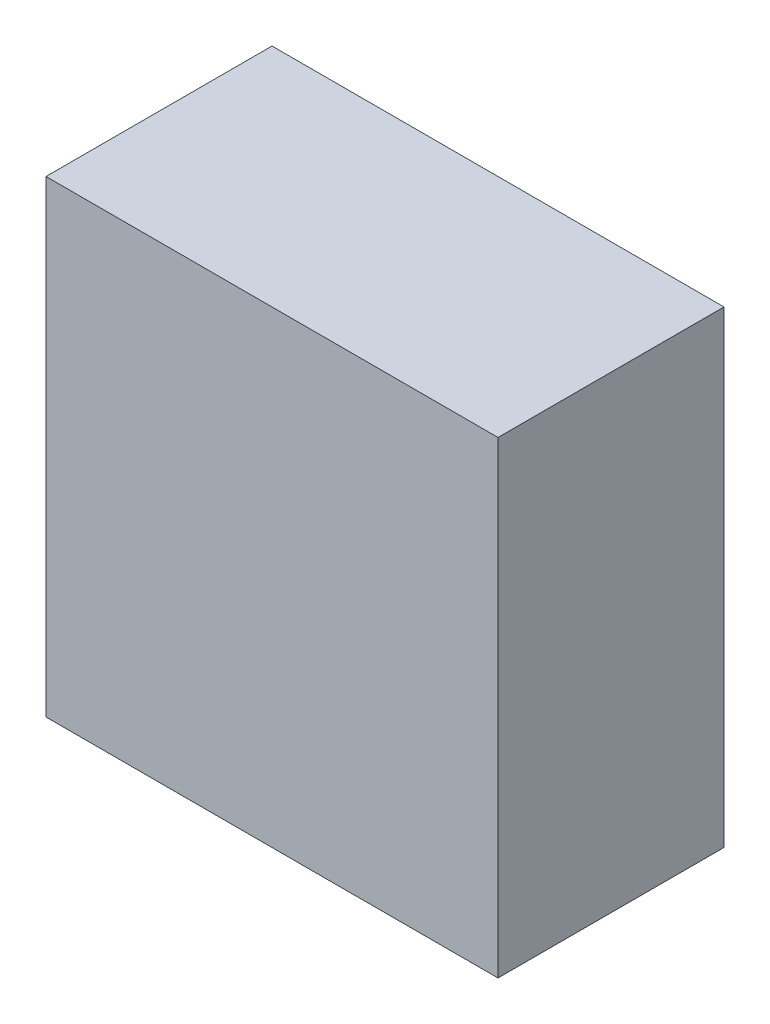
ISO-10303-21;
HEADER;
FILE_DESCRIPTION(('STEP AP214'),'2;1');
FILE_NAME('part.step','',(''),(''),'','','');
FILE_SCHEMA(('AUTOMOTIVE_DESIGN { 1 0 10303 214 1 1 1 1 }'));
ENDSEC;
DATA;
#1=APPLICATION_CONTEXT('core data for automotive mechanical design processes');
#2=APPLICATION_PROTOCOL_DEFINITION('international standard','automotive_design',2000,#1);
#3=PRODUCT_CONTEXT('',#1,'mechanical');
#4=PRODUCT('Part','Part','',(#3));
#5=PRODUCT_RELATED_PRODUCT_CATEGORY('part','',(#4));
#6=PRODUCT_DEFINITION_FORMATION('','',#4);
#7=PRODUCT_DEFINITION_CONTEXT('part definition',#1,'design');
#8=PRODUCT_DEFINITION('design','',#6,#7);
#9=PRODUCT_DEFINITION_SHAPE('','',#8);
#10=(LENGTH_UNIT() NAMED_UNIT(*) SI_UNIT(.MILLI.,.METRE.));
#11=(NAMED_UNIT(*) PLANE_ANGLE_UNIT() SI_UNIT($,.RADIAN.));
#12=(NAMED_UNIT(*) SI_UNIT($,.STERADIAN.) SOLID_ANGLE_UNIT());
#13=UNCERTAINTY_MEASURE_WITH_UNIT(LENGTH_MEASURE(1.E-05),#10,'distance_accuracy_value','');
#14=(GEOMETRIC_REPRESENTATION_CONTEXT(3) GLOBAL_UNCERTAINTY_ASSIGNED_CONTEXT((#13)) GLOBAL_UNIT_ASSIGNED_CONTEXT((#10,
#11,#12)) REPRESENTATION_CONTEXT('',''));
#15=CARTESIAN_POINT('',(0.,0.,0.));
#16=DIRECTION('',(0.,0.,1.));
#17=DIRECTION('',(1.,0.,0.));
#18=AXIS2_PLACEMENT_3D('',#15,#16,#17);
#19=CARTESIAN_POINT('',(-0.699987070088298,0.724970573333906,0.));
#20=DIRECTION('',(-1.,4.37113882867379E-08,0.));
#21=DIRECTION('',(-4.37113882867379E-08,-1.,0.));
#22=AXIS2_PLACEMENT_3D('',#19,#20,#21);
#23=PLANE('',#22);
#24=DIRECTION('',(-4.37113883156005E-08,-0.999999999999999,0.));
#25=VECTOR('',#24,1.);
#26=CARTESIAN_POINT('',(-0.699987070088298,0.724970573333906,0.));
#27=LINE('',#26,#25);
#28=CARTESIAN_POINT('',(-0.699987070088298,0.724970573333906,0.));
#29=VERTEX_POINT('',#28);
#30=CARTESIAN_POINT('',(-0.699987133469008,-0.725011116119219,0.));
#31=VERTEX_POINT('',#30);
#32=EDGE_CURVE('E11',#29,#31,#27,.T.);
#33=ORIENTED_EDGE('',*,*,#32,.T.);
#34=DIRECTION('',(0.,0.,1.));
#35=VECTOR('',#34,1.);
#36=CARTESIAN_POINT('',(-0.699987133469011,-0.725011116119219,0.));
#37=LINE('',#36,#35);
#38=CARTESIAN_POINT('',(-0.699987133469008,-0.725011116119219,0.700001120567322));
#39=VERTEX_POINT('',#38);
#40=EDGE_CURVE('E88',#31,#39,#37,.T.);
#41=ORIENTED_EDGE('',*,*,#40,.T.);
#42=DIRECTION('',(-4.37113883156005E-08,-0.999999999999999,0.));
#43=VECTOR('',#42,1.);
#44=CARTESIAN_POINT('',(-0.699987070088298,0.724970573333906,0.700001120567322));
#45=LINE('',#44,#43);
#46=CARTESIAN_POINT('',(-0.699987070088298,0.724970573333906,0.700001120567322));
#47=VERTEX_POINT('',#46);
#48=EDGE_CURVE('E83',#47,#39,#45,.T.);
#49=ORIENTED_EDGE('',*,*,#48,.F.);
#50=DIRECTION('',(0.,0.,1.));
#51=VECTOR('',#50,1.);
#52=CARTESIAN_POINT('',(-0.699987070088298,0.72497057333394,0.));
#53=LINE('',#52,#51);
#54=EDGE_CURVE('E72',#29,#47,#53,.T.);
#55=ORIENTED_EDGE('',*,*,#54,.F.);
#56=EDGE_LOOP('',(#33,#41,#49,#55));
#57=FACE_BOUND('',#56,.T.);
#58=ADVANCED_FACE('F17',(#57),#23,.T.);
#59=CARTESIAN_POINT('',(-0.699987133469008,-0.725011116119219,0.));
#60=DIRECTION('',(-4.37113882867379E-08,-1.,0.));
#61=DIRECTION('',(1.,-4.37113882867379E-08,0.));
#62=AXIS2_PLACEMENT_3D('',#59,#60,#61);
#63=PLANE('',#62);
#64=DIRECTION('',(0.999999999999999,-4.3711388257813E-08,0.));
#65=VECTOR('',#64,1.);
#66=CARTESIAN_POINT('',(-0.699987133469008,-0.725011116119219,0.));
#67=LINE('',#66,#65);
#68=CARTESIAN_POINT('',(0.700014392409898,-0.725011177315196,0.));
#69=VERTEX_POINT('',#68);
#70=EDGE_CURVE('E24',#31,#69,#67,.T.);
#71=ORIENTED_EDGE('',*,*,#70,.T.);
#72=DIRECTION('',(0.,0.,1.));
#73=VECTOR('',#72,1.);
#74=CARTESIAN_POINT('',(0.700014392409898,-0.72501117731523,0.));
#75=LINE('',#74,#73);
#76=CARTESIAN_POINT('',(0.700014392409898,-0.725011177315196,0.700001120567322));
#77=VERTEX_POINT('',#76);
#78=EDGE_CURVE('E85',#69,#77,#75,.T.);
#79=ORIENTED_EDGE('',*,*,#78,.T.);
#80=DIRECTION('',(0.999999999999999,-4.3711388257813E-08,0.));
#81=VECTOR('',#80,1.);
#82=CARTESIAN_POINT('',(-0.699987133469008,-0.725011116119219,0.700001120567322));
#83=LINE('',#82,#81);
#84=EDGE_CURVE('E66',#39,#77,#83,.T.);
#85=ORIENTED_EDGE('',*,*,#84,.F.);
#86=ORIENTED_EDGE('',*,*,#40,.F.);
#87=EDGE_LOOP('',(#71,#79,#85,#86));
#88=FACE_BOUND('',#87,.T.);
#89=ADVANCED_FACE('F89',(#88),#63,.T.);
#90=CARTESIAN_POINT('',(0.700014392409898,-0.725011177315196,0.));
#91=DIRECTION('',(1.,-4.37113882867379E-08,0.));
#92=DIRECTION('',(4.37113882867379E-08,1.,0.));
#93=AXIS2_PLACEMENT_3D('',#90,#91,#92);
#94=PLANE('',#93);
#95=DIRECTION('',(4.37113883156005E-08,0.999999999999999,0.));
#96=VECTOR('',#95,1.);
#97=CARTESIAN_POINT('',(0.700014392409898,-0.725011177315196,0.));
#98=LINE('',#97,#96);
#99=CARTESIAN_POINT('',(0.700014455790608,0.724970512137929,0.));
#100=VERTEX_POINT('',#99);
#101=EDGE_CURVE('E62',#69,#100,#98,.T.);
#102=ORIENTED_EDGE('',*,*,#101,.T.);
#103=DIRECTION('',(0.,0.,1.));
#104=VECTOR('',#103,1.);
#105=CARTESIAN_POINT('',(0.700014455790611,0.724970512137929,0.));
#106=LINE('',#105,#104);
#107=CARTESIAN_POINT('',(0.700014455790608,0.724970512137929,0.700001120567322));
#108=VERTEX_POINT('',#107);
#109=EDGE_CURVE('E55',#100,#108,#106,.T.);
#110=ORIENTED_EDGE('',*,*,#109,.T.);
#111=DIRECTION('',(4.37113883156005E-08,0.999999999999999,0.));
#112=VECTOR('',#111,1.);
#113=CARTESIAN_POINT('',(0.700014392409898,-0.725011177315196,0.700001120567322));
#114=LINE('',#113,#112);
#115=EDGE_CURVE('E59',#77,#108,#114,.T.);
#116=ORIENTED_EDGE('',*,*,#115,.F.);
#117=ORIENTED_EDGE('',*,*,#78,.F.);
#118=EDGE_LOOP('',(#102,#110,#116,#117));
#119=FACE_BOUND('',#118,.T.);
#120=ADVANCED_FACE('F57',(#119),#94,.T.);
#121=CARTESIAN_POINT('',(0.700014455790608,0.724970512137929,0.));
#122=DIRECTION('',(4.37113882867379E-08,1.,0.));
#123=DIRECTION('',(-1.,4.37113882867379E-08,0.));
#124=AXIS2_PLACEMENT_3D('',#121,#122,#123);
#125=PLANE('',#124);
#126=DIRECTION('',(-0.999999999999999,4.3711388257813E-08,0.));
#127=VECTOR('',#126,1.);
#128=CARTESIAN_POINT('',(0.700014455790608,0.724970512137929,0.));
#129=LINE('',#128,#127);
#130=EDGE_CURVE('E65',#100,#29,#129,.T.);
#131=ORIENTED_EDGE('',*,*,#130,.T.);
#132=ORIENTED_EDGE('',*,*,#54,.T.);
#133=DIRECTION('',(-0.999999999999999,4.3711388257813E-08,0.));
#134=VECTOR('',#133,1.);
#135=CARTESIAN_POINT('',(0.700014455790608,0.724970512137929,0.700001120567322));
#136=LINE('',#135,#134);
#137=EDGE_CURVE('E70',#108,#47,#136,.T.);
#138=ORIENTED_EDGE('',*,*,#137,.F.);
#139=ORIENTED_EDGE('',*,*,#109,.F.);
#140=EDGE_LOOP('',(#131,#132,#138,#139));
#141=FACE_BOUND('',#140,.T.);
#142=ADVANCED_FACE('F71',(#141),#125,.T.);
#143=CARTESIAN_POINT('',(-115.374969482422,472.899963378906,0.700001120567322));
#144=DIRECTION('',(0.,0.,1.));
#145=DIRECTION('',(-4.37113882867379E-08,-1.,0.));
#146=AXIS2_PLACEMENT_3D('',#143,#144,#145);
#147=PLANE('',#146);
#148=ORIENTED_EDGE('',*,*,#48,.T.);
#149=ORIENTED_EDGE('',*,*,#84,.T.);
#150=ORIENTED_EDGE('',*,*,#115,.T.);
#151=ORIENTED_EDGE('',*,*,#137,.T.);
#152=EDGE_LOOP('',(#148,#149,#150,#151));
#153=FACE_BOUND('',#152,.T.);
#154=ADVANCED_FACE('F76',(#153),#147,.T.);
#155=CARTESIAN_POINT('',(-115.374969482422,472.899963378906,0.));
#156=DIRECTION('',(0.,0.,1.));
#157=DIRECTION('',(-4.37113882867379E-08,-1.,0.));
#158=AXIS2_PLACEMENT_3D('',#155,#156,#157);
#159=PLANE('',#158);
#160=ORIENTED_EDGE('',*,*,#130,.F.);
#161=ORIENTED_EDGE('',*,*,#101,.F.);
#162=ORIENTED_EDGE('',*,*,#70,.F.);
#163=ORIENTED_EDGE('',*,*,#32,.F.);
#164=EDGE_LOOP('',(#160,#161,#162,#163));
#165=FACE_BOUND('',#164,.T.);
#166=ADVANCED_FACE('F91',(#165),#159,.F.);
#167=CLOSED_SHELL('',(#58,#89,#120,#142,#154,#166));
#168=MANIFOLD_SOLID_BREP('B1',#167);
#169=ADVANCED_BREP_SHAPE_REPRESENTATION('',(#18,#168),#14);
#170=SHAPE_DEFINITION_REPRESENTATION(#9,#169);
ENDSEC;
END-ISO-10303-21;
